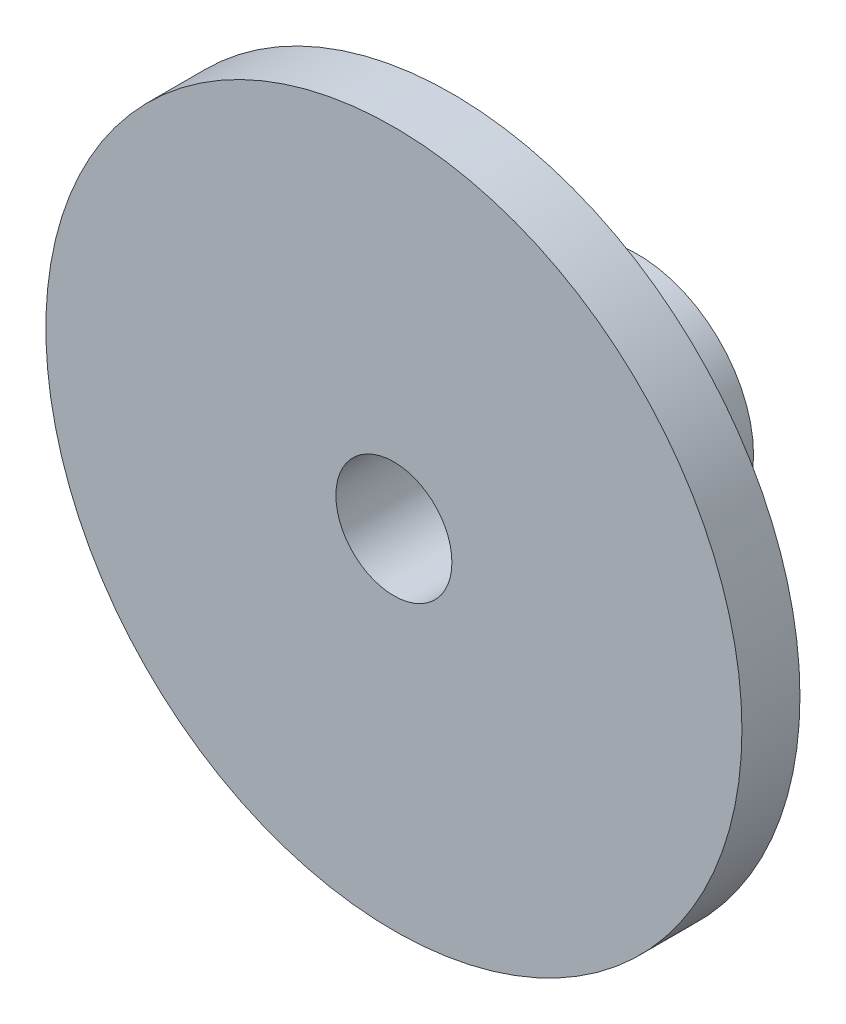
ISO-10303-21;
HEADER;
FILE_DESCRIPTION(('STEP AP214'),'2;1');
FILE_NAME('part.step','',(''),(''),'','','');
FILE_SCHEMA(('AUTOMOTIVE_DESIGN { 1 0 10303 214 1 1 1 1 }'));
ENDSEC;
DATA;
#1=APPLICATION_CONTEXT('core data for automotive mechanical design processes');
#2=APPLICATION_PROTOCOL_DEFINITION('international standard','automotive_design',2000,#1);
#3=PRODUCT_CONTEXT('',#1,'mechanical');
#4=PRODUCT('Part','Part','',(#3));
#5=PRODUCT_RELATED_PRODUCT_CATEGORY('part','',(#4));
#6=PRODUCT_DEFINITION_FORMATION('','',#4);
#7=PRODUCT_DEFINITION_CONTEXT('part definition',#1,'design');
#8=PRODUCT_DEFINITION('design','',#6,#7);
#9=PRODUCT_DEFINITION_SHAPE('','',#8);
#10=(LENGTH_UNIT() NAMED_UNIT(*) SI_UNIT(.MILLI.,.METRE.));
#11=(NAMED_UNIT(*) PLANE_ANGLE_UNIT() SI_UNIT($,.RADIAN.));
#12=(NAMED_UNIT(*) SI_UNIT($,.STERADIAN.) SOLID_ANGLE_UNIT());
#13=UNCERTAINTY_MEASURE_WITH_UNIT(LENGTH_MEASURE(1.E-05),#10,'distance_accuracy_value','');
#14=(GEOMETRIC_REPRESENTATION_CONTEXT(3) GLOBAL_UNCERTAINTY_ASSIGNED_CONTEXT((#13)) GLOBAL_UNIT_ASSIGNED_CONTEXT((#10,
#11,#12)) REPRESENTATION_CONTEXT('',''));
#15=CARTESIAN_POINT('',(0.,0.,0.));
#16=DIRECTION('',(0.,0.,1.));
#17=DIRECTION('',(1.,0.,0.));
#18=AXIS2_PLACEMENT_3D('',#15,#16,#17);
#19=CARTESIAN_POINT('',(0.,0.,0.));
#20=DIRECTION('',(0.,0.,1.));
#21=DIRECTION('',(1.,0.,0.));
#22=AXIS2_PLACEMENT_3D('',#19,#20,#21);
#23=PLANE('',#22);
#24=CARTESIAN_POINT('',(0.,0.,0.));
#25=DIRECTION('',(0.,0.,1.));
#26=DIRECTION('',(1.,0.,0.));
#27=AXIS2_PLACEMENT_3D('',#24,#25,#26);
#28=CIRCLE('',#27,19.05);
#29=CARTESIAN_POINT('',(19.05,0.,0.));
#30=VERTEX_POINT('',#29);
#31=EDGE_CURVE('E46',#30,#30,#28,.T.);
#32=ORIENTED_EDGE('',*,*,#31,.F.);
#33=EDGE_LOOP('',(#32));
#34=FACE_BOUND('',#33,.T.);
#35=CARTESIAN_POINT('',(0.,0.,0.));
#36=DIRECTION('',(0.,0.,1.));
#37=DIRECTION('',(1.,0.,0.));
#38=AXIS2_PLACEMENT_3D('',#35,#36,#37);
#39=CIRCLE('',#38,6.35);
#40=CARTESIAN_POINT('',(6.35,0.,0.));
#41=VERTEX_POINT('',#40);
#42=EDGE_CURVE('E10',#41,#41,#39,.F.);
#43=ORIENTED_EDGE('',*,*,#42,.F.);
#44=EDGE_LOOP('',(#43));
#45=FACE_BOUND('',#44,.T.);
#46=ADVANCED_FACE('F35',(#34,#45),#23,.F.);
#47=CARTESIAN_POINT('',(0.,0.,3.175));
#48=DIRECTION('',(0.,0.,1.));
#49=DIRECTION('',(1.,0.,0.));
#50=AXIS2_PLACEMENT_3D('',#47,#48,#49);
#51=PLANE('',#50);
#52=CARTESIAN_POINT('',(0.,0.,3.175));
#53=DIRECTION('',(0.,0.,1.));
#54=DIRECTION('',(1.,0.,0.));
#55=AXIS2_PLACEMENT_3D('',#52,#53,#54);
#56=CIRCLE('',#55,19.05);
#57=CARTESIAN_POINT('',(19.05,0.,3.175));
#58=VERTEX_POINT('',#57);
#59=EDGE_CURVE('E42',#58,#58,#56,.T.);
#60=ORIENTED_EDGE('',*,*,#59,.T.);
#61=EDGE_LOOP('',(#60));
#62=FACE_BOUND('',#61,.T.);
#63=CARTESIAN_POINT('',(0.,0.,3.175));
#64=DIRECTION('',(0.,0.,1.));
#65=DIRECTION('',(1.,0.,0.));
#66=AXIS2_PLACEMENT_3D('',#63,#64,#65);
#67=CIRCLE('',#66,3.175);
#68=CARTESIAN_POINT('',(3.175,0.,3.175));
#69=VERTEX_POINT('',#68);
#70=EDGE_CURVE('E51',#69,#69,#67,.T.);
#71=ORIENTED_EDGE('',*,*,#70,.F.);
#72=EDGE_LOOP('',(#71));
#73=FACE_BOUND('',#72,.T.);
#74=ADVANCED_FACE('F78',(#62,#73),#51,.T.);
#75=CARTESIAN_POINT('',(0.,0.,3.175));
#76=DIRECTION('',(0.,0.,-1.));
#77=DIRECTION('',(-1.,0.,0.));
#78=AXIS2_PLACEMENT_3D('',#75,#76,#77);
#79=CYLINDRICAL_SURFACE('',#78,19.05);
#80=ORIENTED_EDGE('',*,*,#59,.F.);
#81=EDGE_LOOP('',(#80));
#82=FACE_BOUND('',#81,.T.);
#83=ORIENTED_EDGE('',*,*,#31,.T.);
#84=EDGE_LOOP('',(#83));
#85=FACE_BOUND('',#84,.T.);
#86=ADVANCED_FACE('F37',(#82,#85),#79,.T.);
#87=CARTESIAN_POINT('',(0.,0.,3.175));
#88=DIRECTION('',(0.,0.,-1.));
#89=DIRECTION('',(-1.,0.,0.));
#90=AXIS2_PLACEMENT_3D('',#87,#88,#89);
#91=CYLINDRICAL_SURFACE('',#90,3.175);
#92=ORIENTED_EDGE('',*,*,#70,.T.);
#93=EDGE_LOOP('',(#92));
#94=FACE_BOUND('',#93,.T.);
#95=CARTESIAN_POINT('',(0.,0.,-10.16));
#96=DIRECTION('',(0.,0.,-1.));
#97=DIRECTION('',(-1.,0.,0.));
#98=AXIS2_PLACEMENT_3D('',#95,#96,#97);
#99=CIRCLE('',#98,3.175);
#100=CARTESIAN_POINT('',(-3.175,0.,-10.16));
#101=VERTEX_POINT('',#100);
#102=EDGE_CURVE('E58',#101,#101,#99,.T.);
#103=ORIENTED_EDGE('',*,*,#102,.T.);
#104=EDGE_LOOP('',(#103));
#105=FACE_BOUND('',#104,.T.);
#106=ADVANCED_FACE('F62',(#94,#105),#91,.F.);
#107=CARTESIAN_POINT('',(0.,0.,-10.16));
#108=DIRECTION('',(0.,0.,-1.));
#109=DIRECTION('',(-1.,0.,0.));
#110=AXIS2_PLACEMENT_3D('',#107,#108,#109);
#111=PLANE('',#110);
#112=CARTESIAN_POINT('',(0.,0.,-10.16));
#113=DIRECTION('',(0.,0.,-1.));
#114=DIRECTION('',(-1.,0.,0.));
#115=AXIS2_PLACEMENT_3D('',#112,#113,#114);
#116=CIRCLE('',#115,6.35);
#117=CARTESIAN_POINT('',(-6.35,0.,-10.16));
#118=VERTEX_POINT('',#117);
#119=EDGE_CURVE('E55',#118,#118,#116,.T.);
#120=ORIENTED_EDGE('',*,*,#119,.T.);
#121=EDGE_LOOP('',(#120));
#122=FACE_BOUND('',#121,.T.);
#123=ORIENTED_EDGE('',*,*,#102,.F.);
#124=EDGE_LOOP('',(#123));
#125=FACE_BOUND('',#124,.T.);
#126=ADVANCED_FACE('F64',(#122,#125),#111,.T.);
#127=CARTESIAN_POINT('',(0.,0.,-10.16));
#128=DIRECTION('',(0.,0.,1.));
#129=DIRECTION('',(1.,0.,0.));
#130=AXIS2_PLACEMENT_3D('',#127,#128,#129);
#131=CYLINDRICAL_SURFACE('',#130,6.35);
#132=ORIENTED_EDGE('',*,*,#119,.F.);
#133=EDGE_LOOP('',(#132));
#134=FACE_BOUND('',#133,.T.);
#135=ORIENTED_EDGE('',*,*,#42,.T.);
#136=EDGE_LOOP('',(#135));
#137=FACE_BOUND('',#136,.T.);
#138=ADVANCED_FACE('F66',(#134,#137),#131,.T.);
#139=CLOSED_SHELL('',(#46,#74,#86,#106,#126,#138));
#140=MANIFOLD_SOLID_BREP('B2',#139);
#141=ADVANCED_BREP_SHAPE_REPRESENTATION('',(#18,#140),#14);
#142=SHAPE_DEFINITION_REPRESENTATION(#9,#141);
ENDSEC;
END-ISO-10303-21;
